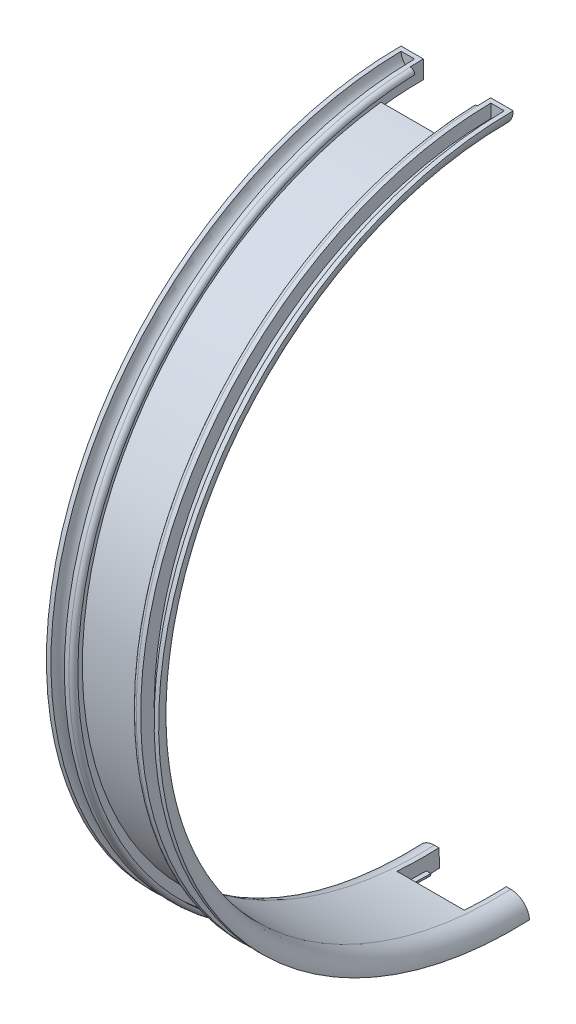
ISO-10303-21;
HEADER;
FILE_DESCRIPTION(('STEP AP214'),'2;1');
FILE_NAME('part.step','',(''),(''),'','','');
FILE_SCHEMA(('AUTOMOTIVE_DESIGN { 1 0 10303 214 1 1 1 1 }'));
ENDSEC;
DATA;
#1=APPLICATION_CONTEXT('core data for automotive mechanical design processes');
#2=APPLICATION_PROTOCOL_DEFINITION('international standard','automotive_design',2000,#1);
#3=PRODUCT_CONTEXT('',#1,'mechanical');
#4=PRODUCT('Part','Part','',(#3));
#5=PRODUCT_RELATED_PRODUCT_CATEGORY('part','',(#4));
#6=PRODUCT_DEFINITION_FORMATION('','',#4);
#7=PRODUCT_DEFINITION_CONTEXT('part definition',#1,'design');
#8=PRODUCT_DEFINITION('design','',#6,#7);
#9=PRODUCT_DEFINITION_SHAPE('','',#8);
#10=(LENGTH_UNIT() NAMED_UNIT(*) SI_UNIT(.MILLI.,.METRE.));
#11=(NAMED_UNIT(*) PLANE_ANGLE_UNIT() SI_UNIT($,.RADIAN.));
#12=(NAMED_UNIT(*) SI_UNIT($,.STERADIAN.) SOLID_ANGLE_UNIT());
#13=UNCERTAINTY_MEASURE_WITH_UNIT(LENGTH_MEASURE(1.E-05),#10,'distance_accuracy_value','');
#14=(GEOMETRIC_REPRESENTATION_CONTEXT(3) GLOBAL_UNCERTAINTY_ASSIGNED_CONTEXT((#13)) GLOBAL_UNIT_ASSIGNED_CONTEXT((#10,
#11,#12)) REPRESENTATION_CONTEXT('',''));
#15=CARTESIAN_POINT('',(0.,0.,0.));
#16=DIRECTION('',(0.,0.,1.));
#17=DIRECTION('',(1.,0.,0.));
#18=AXIS2_PLACEMENT_3D('',#15,#16,#17);
#19=CARTESIAN_POINT('',(-12.427210773158,-68.4885649281417,0.));
#20=DIRECTION('',(-1.,0.,0.));
#21=DIRECTION('',(0.,0.,1.));
#22=AXIS2_PLACEMENT_3D('',#19,#20,#21);
#23=CYLINDRICAL_SURFACE('',#22,78.);
#24=CARTESIAN_POINT('',(2.57278922684203,-68.4885649281417,0.));
#25=DIRECTION('',(-1.,0.,0.));
#26=DIRECTION('',(0.,0.,1.));
#27=AXIS2_PLACEMENT_3D('',#24,#25,#26);
#28=CIRCLE('',#27,78.);
#29=CARTESIAN_POINT('',(2.57278922684203,-146.485824953885,-0.653780143942316));
#30=VERTEX_POINT('',#29);
#31=CARTESIAN_POINT('',(2.57278922684203,9.45652584852879,2.92623030819482));
#32=VERTEX_POINT('',#31);
#33=EDGE_CURVE('E210',#30,#32,#28,.T.);
#34=ORIENTED_EDGE('',*,*,#33,.T.);
#35=DIRECTION('',(-1.,0.,0.));
#36=VECTOR('',#35,1.);
#37=CARTESIAN_POINT('',(0.,9.45652584852879,2.92623030819482));
#38=LINE('',#37,#36);
#39=CARTESIAN_POINT('',(3.57278922684203,9.45652584852879,2.92623030819482));
#40=VERTEX_POINT('',#39);
#41=EDGE_CURVE('E200',#40,#32,#38,.T.);
#42=ORIENTED_EDGE('',*,*,#41,.F.);
#43=CARTESIAN_POINT('',(3.57278922684203,-68.4885649281417,0.));
#44=DIRECTION('',(-1.,0.,0.));
#45=DIRECTION('',(0.,0.,1.));
#46=AXIS2_PLACEMENT_3D('',#43,#44,#45);
#47=CIRCLE('',#46,78.);
#48=CARTESIAN_POINT('',(3.57278922684203,-146.485824953885,-0.653780143942316));
#49=VERTEX_POINT('',#48);
#50=EDGE_CURVE('E47',#49,#40,#47,.T.);
#51=ORIENTED_EDGE('',*,*,#50,.F.);
#52=DIRECTION('',(1.,0.,0.));
#53=VECTOR('',#52,1.);
#54=CARTESIAN_POINT('',(0.,-146.485824953885,-0.653780143942316));
#55=LINE('',#54,#53);
#56=EDGE_CURVE('E364',#30,#49,#55,.T.);
#57=ORIENTED_EDGE('',*,*,#56,.F.);
#58=EDGE_LOOP('',(#34,#42,#51,#57));
#59=FACE_BOUND('',#58,.T.);
#60=ADVANCED_FACE('F39',(#59),#23,.F.);
#61=CARTESIAN_POINT('',(3.57278922684203,-68.4885649281417,0.));
#62=DIRECTION('',(-1.,0.,0.));
#63=DIRECTION('',(0.,0.,1.));
#64=AXIS2_PLACEMENT_3D('',#61,#62,#63);
#65=TOROIDAL_SURFACE('',#64,78.,0.999999999999999);
#66=CARTESIAN_POINT('',(3.57278922684203,9.45652584852878,2.92623030819482));
#67=DIRECTION('',(0.,0.0375157731819848,-0.99929603559834));
#68=DIRECTION('',(0.,0.99929603559834,0.0375157731819848));
#69=AXIS2_PLACEMENT_3D('',#66,#67,#68);
#70=CIRCLE('',#69,0.999999999999999);
#71=CARTESIAN_POINT('',(3.57278922684203,10.4558218841271,2.9637460813768));
#72=VERTEX_POINT('',#71);
#73=EDGE_CURVE('E202',#32,#72,#70,.T.);
#74=ORIENTED_EDGE('',*,*,#73,.F.);
#75=ORIENTED_EDGE('',*,*,#33,.F.);
#76=CARTESIAN_POINT('',(3.57278922684203,-146.485824953885,-0.653780143942316));
#77=DIRECTION('',(0.,0.00838179671720921,-0.999964872124912));
#78=DIRECTION('',(0.,0.999964872124912,0.00838179671720921));
#79=AXIS2_PLACEMENT_3D('',#76,#77,#78);
#80=CIRCLE('',#79,0.999999999999999);
#81=CARTESIAN_POINT('',(3.57278922684203,-147.48578982601,-0.662161940659527));
#82=VERTEX_POINT('',#81);
#83=EDGE_CURVE('E366',#82,#30,#80,.T.);
#84=ORIENTED_EDGE('',*,*,#83,.F.);
#85=CARTESIAN_POINT('',(3.57278922684203,-68.4885649281417,0.));
#86=DIRECTION('',(-1.,0.,0.));
#87=DIRECTION('',(0.,0.,1.));
#88=AXIS2_PLACEMENT_3D('',#85,#86,#87);
#89=CIRCLE('',#88,79.);
#90=EDGE_CURVE('E251',#82,#72,#89,.T.);
#91=ORIENTED_EDGE('',*,*,#90,.T.);
#92=EDGE_LOOP('',(#74,#75,#84,#91));
#93=FACE_BOUND('',#92,.T.);
#94=ADVANCED_FACE('F414',(#93),#65,.T.);
#95=CARTESIAN_POINT('',(-12.427210773158,-68.4885649281417,0.));
#96=DIRECTION('',(-1.,0.,0.));
#97=DIRECTION('',(0.,0.,1.));
#98=AXIS2_PLACEMENT_3D('',#95,#96,#97);
#99=CYLINDRICAL_SURFACE('',#98,78.);
#100=DIRECTION('',(1.,0.,0.));
#101=VECTOR('',#100,1.);
#102=CARTESIAN_POINT('',(0.,9.45652584852879,2.92623030819482));
#103=LINE('',#102,#101);
#104=CARTESIAN_POINT('',(-11.427210773158,9.45652584852879,2.92623030819482));
#105=VERTEX_POINT('',#104);
#106=CARTESIAN_POINT('',(-10.427210773158,9.45652584852879,2.92623030819482));
#107=VERTEX_POINT('',#106);
#108=EDGE_CURVE('E381',#105,#107,#103,.T.);
#109=ORIENTED_EDGE('',*,*,#108,.T.);
#110=CARTESIAN_POINT('',(-10.427210773158,-68.4885649281417,0.));
#111=DIRECTION('',(-1.,0.,0.));
#112=DIRECTION('',(0.,0.,1.));
#113=AXIS2_PLACEMENT_3D('',#110,#111,#112);
#114=CIRCLE('',#113,78.);
#115=CARTESIAN_POINT('',(-10.427210773158,-146.485824953885,-0.653780143942318));
#116=VERTEX_POINT('',#115);
#117=EDGE_CURVE('E221',#116,#107,#114,.T.);
#118=ORIENTED_EDGE('',*,*,#117,.F.);
#119=DIRECTION('',(1.,0.,0.));
#120=VECTOR('',#119,1.);
#121=CARTESIAN_POINT('',(0.,-146.485824953885,-0.653780143942316));
#122=LINE('',#121,#120);
#123=CARTESIAN_POINT('',(-11.427210773158,-146.485824953885,-0.653780143942316));
#124=VERTEX_POINT('',#123);
#125=EDGE_CURVE('E372',#124,#116,#122,.T.);
#126=ORIENTED_EDGE('',*,*,#125,.F.);
#127=CARTESIAN_POINT('',(-11.427210773158,-68.4885649281417,0.));
#128=DIRECTION('',(-1.,0.,0.));
#129=DIRECTION('',(0.,0.,1.));
#130=AXIS2_PLACEMENT_3D('',#127,#128,#129);
#131=CIRCLE('',#130,78.);
#132=EDGE_CURVE('E218',#124,#105,#131,.T.);
#133=ORIENTED_EDGE('',*,*,#132,.T.);
#134=EDGE_LOOP('',(#109,#118,#126,#133));
#135=FACE_BOUND('',#134,.T.);
#136=ADVANCED_FACE('F386',(#135),#99,.F.);
#137=CARTESIAN_POINT('',(-11.427210773158,-68.4885649281417,0.));
#138=DIRECTION('',(-1.,0.,0.));
#139=DIRECTION('',(0.,0.,1.));
#140=AXIS2_PLACEMENT_3D('',#137,#138,#139);
#141=TOROIDAL_SURFACE('',#140,78.,1.);
#142=CARTESIAN_POINT('',(-11.427210773158,9.45652584852878,2.92623030819482));
#143=DIRECTION('',(0.,0.0375157731819848,-0.99929603559834));
#144=DIRECTION('',(0.,0.99929603559834,0.0375157731819848));
#145=AXIS2_PLACEMENT_3D('',#142,#143,#144);
#146=CIRCLE('',#145,1.);
#147=CARTESIAN_POINT('',(-11.427210773158,10.4558218841271,2.9637460813768));
#148=VERTEX_POINT('',#147);
#149=EDGE_CURVE('E374',#148,#107,#146,.T.);
#150=ORIENTED_EDGE('',*,*,#149,.F.);
#151=CARTESIAN_POINT('',(-11.427210773158,-68.4885649281417,0.));
#152=DIRECTION('',(-1.,0.,0.));
#153=DIRECTION('',(0.,0.,1.));
#154=AXIS2_PLACEMENT_3D('',#151,#152,#153);
#155=CIRCLE('',#154,79.);
#156=CARTESIAN_POINT('',(-11.427210773158,-147.48578982601,-0.662161940659525));
#157=VERTEX_POINT('',#156);
#158=EDGE_CURVE('E227',#157,#148,#155,.T.);
#159=ORIENTED_EDGE('',*,*,#158,.F.);
#160=CARTESIAN_POINT('',(-11.427210773158,-146.485824953885,-0.653780143942318));
#161=DIRECTION('',(0.,0.00838179671720921,-0.999964872124912));
#162=DIRECTION('',(0.,0.999964872124912,0.00838179671720921));
#163=AXIS2_PLACEMENT_3D('',#160,#161,#162);
#164=CIRCLE('',#163,1.);
#165=EDGE_CURVE('E11',#116,#157,#164,.T.);
#166=ORIENTED_EDGE('',*,*,#165,.F.);
#167=ORIENTED_EDGE('',*,*,#117,.T.);
#168=EDGE_LOOP('',(#150,#159,#166,#167));
#169=FACE_BOUND('',#168,.T.);
#170=ADVANCED_FACE('F394',(#169),#141,.T.);
#171=CARTESIAN_POINT('',(0.,-136.904975979753,-3.14296432261756));
#172=DIRECTION('',(0.,0.045890351563289,-0.998946482867525));
#173=DIRECTION('',(1.,0.,0.));
#174=AXIS2_PLACEMENT_3D('',#171,#172,#173);
#175=PLANE('',#174);
#176=DIRECTION('',(0.,0.998946482867525,0.045890351563289));
#177=VECTOR('',#176,1.);
#178=CARTESIAN_POINT('',(-11.427210773158,-136.904975979753,-3.14296432261756));
#179=LINE('',#178,#177);
#180=CARTESIAN_POINT('',(-11.427210773158,-147.405337074676,-3.62533777349983));
#181=VERTEX_POINT('',#180);
#182=CARTESIAN_POINT('',(-11.427210773158,-143.409551143206,-3.44177636724667));
#183=VERTEX_POINT('',#182);
#184=EDGE_CURVE('E270',#181,#183,#179,.T.);
#185=ORIENTED_EDGE('',*,*,#184,.F.);
#186=DIRECTION('',(1.,0.,0.));
#187=VECTOR('',#186,1.);
#188=CARTESIAN_POINT('',(0.,-147.405337074676,-3.62533777349983));
#189=LINE('',#188,#187);
#190=CARTESIAN_POINT('',(-16.427210773158,-147.405337074676,-3.62533777349983));
#191=VERTEX_POINT('',#190);
#192=EDGE_CURVE('E267',#191,#181,#189,.T.);
#193=ORIENTED_EDGE('',*,*,#192,.F.);
#194=CARTESIAN_POINT('',(-12.427210773158,-147.405337074676,-3.62533777349983));
#195=DIRECTION('',(0.,0.045890351563289,-0.998946482867525));
#196=DIRECTION('',(1.,0.,0.));
#197=AXIS2_PLACEMENT_3D('',#194,#195,#196);
#198=CIRCLE('',#197,4.);
#199=CARTESIAN_POINT('',(-12.427210773158,-143.409551143206,-3.44177636724667));
#200=VERTEX_POINT('',#199);
#201=EDGE_CURVE('E264',#191,#200,#198,.T.);
#202=ORIENTED_EDGE('',*,*,#201,.T.);
#203=DIRECTION('',(1.,0.,0.));
#204=VECTOR('',#203,1.);
#205=CARTESIAN_POINT('',(0.,-143.409551143206,-3.44177636724667));
#206=LINE('',#205,#204);
#207=EDGE_CURVE('E260',#200,#183,#206,.T.);
#208=ORIENTED_EDGE('',*,*,#207,.T.);
#209=EDGE_LOOP('',(#185,#193,#202,#208));
#210=FACE_BOUND('',#209,.T.);
#211=ADVANCED_FACE('F422',(#210),#175,.T.);
#212=DIRECTION('',(-1.,0.,0.));
#213=VECTOR('',#212,1.);
#214=CARTESIAN_POINT('',(0.,-147.405337074676,-3.62533777349983));
#215=LINE('',#214,#213);
#216=CARTESIAN_POINT('',(8.57278922684203,-147.405337074676,-3.62533777349983));
#217=VERTEX_POINT('',#216);
#218=CARTESIAN_POINT('',(3.57278922684203,-147.405337074676,-3.62533777349983));
#219=VERTEX_POINT('',#218);
#220=EDGE_CURVE('E254',#217,#219,#215,.T.);
#221=ORIENTED_EDGE('',*,*,#220,.T.);
#222=DIRECTION('',(0.,0.998946482867525,0.045890351563289));
#223=VECTOR('',#222,1.);
#224=CARTESIAN_POINT('',(3.57278922684203,-136.904975979753,-3.14296432261756));
#225=LINE('',#224,#223);
#226=CARTESIAN_POINT('',(3.57278922684203,-143.409551143206,-3.44177636724667));
#227=VERTEX_POINT('',#226);
#228=EDGE_CURVE('E272',#219,#227,#225,.T.);
#229=ORIENTED_EDGE('',*,*,#228,.T.);
#230=CARTESIAN_POINT('',(4.57278922684203,-143.409551143206,-3.44177636724667));
#231=VERTEX_POINT('',#230);
#232=EDGE_CURVE('E263',#227,#231,#206,.T.);
#233=ORIENTED_EDGE('',*,*,#232,.T.);
#234=CARTESIAN_POINT('',(4.57278922684203,-147.405337074676,-3.62533777349983));
#235=DIRECTION('',(0.,0.045890351563289,-0.998946482867525));
#236=DIRECTION('',(1.,0.,0.));
#237=AXIS2_PLACEMENT_3D('',#234,#235,#236);
#238=CIRCLE('',#237,4.);
#239=EDGE_CURVE('E257',#231,#217,#238,.T.);
#240=ORIENTED_EDGE('',*,*,#239,.T.);
#241=EDGE_LOOP('',(#221,#229,#233,#240));
#242=FACE_BOUND('',#241,.T.);
#243=ADVANCED_FACE('F448',(#242),#175,.T.);
#244=CARTESIAN_POINT('',(-12.427210773158,-68.4885649281417,0.));
#245=DIRECTION('',(-1.,0.,0.));
#246=DIRECTION('',(0.,0.,1.));
#247=AXIS2_PLACEMENT_3D('',#244,#245,#246);
#248=CYLINDRICAL_SURFACE('',#247,75.);
#249=CARTESIAN_POINT('',(3.57278922684203,-68.4885649281417,0.));
#250=DIRECTION('',(1.,0.,0.));
#251=DIRECTION('',(0.,0.,-1.));
#252=AXIS2_PLACEMENT_3D('',#249,#250,#251);
#253=CIRCLE('',#252,75.);
#254=CARTESIAN_POINT('',(3.57278922684203,-143.254299183955,5.92325765006302));
#255=VERTEX_POINT('',#254);
#256=EDGE_CURVE('E347',#255,#227,#253,.T.);
#257=ORIENTED_EDGE('',*,*,#256,.F.);
#258=DIRECTION('',(-1.,0.,0.));
#259=VECTOR('',#258,1.);
#260=CARTESIAN_POINT('',(3.57278922684203,-143.254299183955,5.92325765006302));
#261=LINE('',#260,#259);
#262=CARTESIAN_POINT('',(-11.427210773158,-143.254299183955,5.92325765006302));
#263=VERTEX_POINT('',#262);
#264=EDGE_CURVE('E359',#255,#263,#261,.T.);
#265=ORIENTED_EDGE('',*,*,#264,.T.);
#266=CARTESIAN_POINT('',(-11.427210773158,-68.4885649281417,0.));
#267=DIRECTION('',(1.,0.,0.));
#268=DIRECTION('',(0.,0.,-1.));
#269=AXIS2_PLACEMENT_3D('',#266,#267,#268);
#270=CIRCLE('',#269,75.);
#271=EDGE_CURVE('E350',#263,#183,#270,.T.);
#272=ORIENTED_EDGE('',*,*,#271,.T.);
#273=ORIENTED_EDGE('',*,*,#207,.F.);
#274=CARTESIAN_POINT('',(-12.427210773158,-68.4885649281417,0.));
#275=DIRECTION('',(-1.,0.,0.));
#276=DIRECTION('',(0.,0.,1.));
#277=AXIS2_PLACEMENT_3D('',#274,#275,#276);
#278=CIRCLE('',#277,75.);
#279=CARTESIAN_POINT('',(-12.427210773158,6.51143507185831,0.));
#280=VERTEX_POINT('',#279);
#281=EDGE_CURVE('E236',#200,#280,#278,.T.);
#282=ORIENTED_EDGE('',*,*,#281,.T.);
#283=DIRECTION('',(1.,0.,0.));
#284=VECTOR('',#283,1.);
#285=CARTESIAN_POINT('',(0.,6.51143507185831,0.));
#286=LINE('',#285,#284);
#287=CARTESIAN_POINT('',(-11.427210773158,6.51143507185831,0.));
#288=VERTEX_POINT('',#287);
#289=EDGE_CURVE('E280',#280,#288,#286,.T.);
#290=ORIENTED_EDGE('',*,*,#289,.T.);
#291=CARTESIAN_POINT('',(-11.427210773158,-68.4885649281417,0.));
#292=DIRECTION('',(-1.,0.,0.));
#293=DIRECTION('',(0.,0.,1.));
#294=AXIS2_PLACEMENT_3D('',#291,#292,#293);
#295=CIRCLE('',#294,75.);
#296=CARTESIAN_POINT('',(-11.427210773158,5.92658196975018,9.34804322653535));
#297=VERTEX_POINT('',#296);
#298=EDGE_CURVE('E330',#297,#288,#295,.T.);
#299=ORIENTED_EDGE('',*,*,#298,.F.);
#300=DIRECTION('',(-1.,0.,0.));
#301=VECTOR('',#300,1.);
#302=CARTESIAN_POINT('',(0.,5.92658196975018,9.34804322653535));
#303=LINE('',#302,#301);
#304=CARTESIAN_POINT('',(3.57278922684203,5.92658196975018,9.34804322653535));
#305=VERTEX_POINT('',#304);
#306=EDGE_CURVE('E345',#305,#297,#303,.T.);
#307=ORIENTED_EDGE('',*,*,#306,.F.);
#308=CARTESIAN_POINT('',(3.57278922684203,-68.4885649281417,0.));
#309=DIRECTION('',(-1.,0.,0.));
#310=DIRECTION('',(0.,0.,1.));
#311=AXIS2_PLACEMENT_3D('',#308,#309,#310);
#312=CIRCLE('',#311,75.);
#313=CARTESIAN_POINT('',(3.57278922684203,6.51143507185831,0.));
#314=VERTEX_POINT('',#313);
#315=EDGE_CURVE('E333',#305,#314,#312,.T.);
#316=ORIENTED_EDGE('',*,*,#315,.T.);
#317=CARTESIAN_POINT('',(4.57278922684203,6.51143507185831,0.));
#318=VERTEX_POINT('',#317);
#319=EDGE_CURVE('E283',#314,#318,#286,.T.);
#320=ORIENTED_EDGE('',*,*,#319,.T.);
#321=CARTESIAN_POINT('',(4.57278922684203,-68.4885649281417,0.));
#322=DIRECTION('',(-1.,0.,0.));
#323=DIRECTION('',(0.,0.,1.));
#324=AXIS2_PLACEMENT_3D('',#321,#322,#323);
#325=CIRCLE('',#324,75.);
#326=EDGE_CURVE('E238',#231,#318,#325,.T.);
#327=ORIENTED_EDGE('',*,*,#326,.F.);
#328=ORIENTED_EDGE('',*,*,#232,.F.);
#329=EDGE_LOOP('',(#257,#265,#272,#273,#282,#290,#299,#307,#316,#320,#327,#328));
#330=FACE_BOUND('',#329,.T.);
#331=ADVANCED_FACE('F444',(#330),#248,.F.);
#332=CARTESIAN_POINT('',(-12.427210773158,-68.4885649281417,0.));
#333=DIRECTION('',(-1.,0.,0.));
#334=DIRECTION('',(0.,0.,1.));
#335=AXIS2_PLACEMENT_3D('',#332,#333,#334);
#336=CYLINDRICAL_SURFACE('',#335,76.);
#337=DIRECTION('',(-1.,0.,0.));
#338=VECTOR('',#337,1.);
#339=CARTESIAN_POINT('',(3.57278922684203,-144.2511756407,6.00223441873053));
#340=LINE('',#339,#338);
#341=CARTESIAN_POINT('',(3.57278922684203,-144.2511756407,6.00223441873053));
#342=VERTEX_POINT('',#341);
#343=CARTESIAN_POINT('',(-11.427210773158,-144.2511756407,6.00223441873053));
#344=VERTEX_POINT('',#343);
#345=EDGE_CURVE('E353',#342,#344,#340,.T.);
#346=ORIENTED_EDGE('',*,*,#345,.F.);
#347=CARTESIAN_POINT('',(3.57278922684203,-68.4885649281417,0.));
#348=DIRECTION('',(-1.,0.,0.));
#349=DIRECTION('',(0.,0.,1.));
#350=AXIS2_PLACEMENT_3D('',#347,#348,#349);
#351=CIRCLE('',#350,76.);
#352=CARTESIAN_POINT('',(3.57278922684203,6.91878392838874,9.47268380288915));
#353=VERTEX_POINT('',#352);
#354=EDGE_CURVE('E213',#342,#353,#351,.T.);
#355=ORIENTED_EDGE('',*,*,#354,.T.);
#356=DIRECTION('',(1.,0.,0.));
#357=VECTOR('',#356,1.);
#358=CARTESIAN_POINT('',(0.,6.91878392838874,9.47268380288915));
#359=LINE('',#358,#357);
#360=CARTESIAN_POINT('',(-11.427210773158,6.91878392838874,9.47268380288915));
#361=VERTEX_POINT('',#360);
#362=EDGE_CURVE('E339',#361,#353,#359,.T.);
#363=ORIENTED_EDGE('',*,*,#362,.F.);
#364=CARTESIAN_POINT('',(-11.427210773158,-68.4885649281417,0.));
#365=DIRECTION('',(-1.,0.,0.));
#366=DIRECTION('',(0.,0.,1.));
#367=AXIS2_PLACEMENT_3D('',#364,#365,#366);
#368=CIRCLE('',#367,76.);
#369=EDGE_CURVE('E214',#344,#361,#368,.T.);
#370=ORIENTED_EDGE('',*,*,#369,.F.);
#371=EDGE_LOOP('',(#346,#355,#363,#370));
#372=FACE_BOUND('',#371,.T.);
#373=ADVANCED_FACE('F447',(#372),#336,.T.);
#374=CARTESIAN_POINT('',(0.,0.,0.));
#375=DIRECTION('',(0.,0.,1.));
#376=DIRECTION('',(1.,0.,0.));
#377=AXIS2_PLACEMENT_3D('',#374,#375,#376);
#378=PLANE('',#377);
#379=DIRECTION('',(0.,-1.,0.));
#380=VECTOR('',#379,1.);
#381=CARTESIAN_POINT('',(3.57278922684203,0.,0.));
#382=LINE('',#381,#380);
#383=CARTESIAN_POINT('',(3.57278922684204,10.5114350718583,0.));
#384=VERTEX_POINT('',#383);
#385=EDGE_CURVE('E292',#384,#314,#382,.T.);
#386=ORIENTED_EDGE('',*,*,#385,.F.);
#387=DIRECTION('',(-1.,0.,0.));
#388=VECTOR('',#387,1.);
#389=CARTESIAN_POINT('',(0.,10.5114350718583,0.));
#390=LINE('',#389,#388);
#391=CARTESIAN_POINT('',(8.57278922684203,10.5114350718583,0.));
#392=VERTEX_POINT('',#391);
#393=EDGE_CURVE('E274',#392,#384,#390,.T.);
#394=ORIENTED_EDGE('',*,*,#393,.F.);
#395=CARTESIAN_POINT('',(4.57278922684203,10.5114350718583,0.));
#396=DIRECTION('',(0.,0.,1.));
#397=DIRECTION('',(1.,0.,0.));
#398=AXIS2_PLACEMENT_3D('',#395,#396,#397);
#399=CIRCLE('',#398,4.);
#400=EDGE_CURVE('E277',#318,#392,#399,.T.);
#401=ORIENTED_EDGE('',*,*,#400,.F.);
#402=ORIENTED_EDGE('',*,*,#319,.F.);
#403=EDGE_LOOP('',(#386,#394,#401,#402));
#404=FACE_BOUND('',#403,.T.);
#405=ADVANCED_FACE('F463',(#404),#378,.F.);
#406=CARTESIAN_POINT('',(-12.427210773158,-136.904975979753,-3.14296432261756));
#407=DIRECTION('',(1.,0.,0.));
#408=DIRECTION('',(0.,0.,-1.));
#409=AXIS2_PLACEMENT_3D('',#406,#407,#408);
#410=PLANE('',#409);
#411=DIRECTION('',(0.,0.99944427024063,0.033333926908996));
#412=VECTOR('',#411,1.);
#413=CARTESIAN_POINT('',(-12.427210773158,-0.110174912181108,2.28058764537024));
#414=LINE('',#413,#412);
#415=CARTESIAN_POINT('',(-12.427210773158,-147.444662277151,-2.63338022581068));
#416=VERTEX_POINT('',#415);
#417=CARTESIAN_POINT('',(-12.427210773158,-144.44632946643,-2.53337844508369));
#418=VERTEX_POINT('',#417);
#419=EDGE_CURVE('E321',#416,#418,#414,.T.);
#420=ORIENTED_EDGE('',*,*,#419,.F.);
#421=CARTESIAN_POINT('',(-12.427210773158,-68.4885649281417,0.));
#422=DIRECTION('',(-1.,0.,0.));
#423=DIRECTION('',(0.,0.,1.));
#424=AXIS2_PLACEMENT_3D('',#421,#422,#423);
#425=CIRCLE('',#424,79.);
#426=CARTESIAN_POINT('',(-12.427210773158,10.5051975639598,0.992717150784858));
#427=VERTEX_POINT('',#426);
#428=EDGE_CURVE('E228',#416,#427,#425,.T.);
#429=ORIENTED_EDGE('',*,*,#428,.T.);
#430=DIRECTION('',(0.,0.999921044203816,0.0125660398833526));
#431=VECTOR('',#430,1.);
#432=CARTESIAN_POINT('',(-12.427210773158,-0.00540756917339499,0.860630038440615));
#433=LINE('',#432,#431);
#434=CARTESIAN_POINT('',(-12.427210773158,7.50543443134833,0.9550190311348));
#435=VERTEX_POINT('',#434);
#436=EDGE_CURVE('E306',#435,#427,#433,.T.);
#437=ORIENTED_EDGE('',*,*,#436,.F.);
#438=CARTESIAN_POINT('',(-12.427210773158,-68.4885649281417,0.));
#439=DIRECTION('',(-1.,0.,0.));
#440=DIRECTION('',(0.,0.,1.));
#441=AXIS2_PLACEMENT_3D('',#438,#439,#440);
#442=CIRCLE('',#441,76.);
#443=EDGE_CURVE('E230',#418,#435,#442,.T.);
#444=ORIENTED_EDGE('',*,*,#443,.F.);
#445=EDGE_LOOP('',(#420,#429,#437,#444));
#446=FACE_BOUND('',#445,.T.);
#447=ADVANCED_FACE('F459',(#446),#410,.F.);
#448=CARTESIAN_POINT('',(-12.427210773158,-68.4885649281417,0.));
#449=DIRECTION('',(-1.,0.,0.));
#450=DIRECTION('',(0.,0.,1.));
#451=AXIS2_PLACEMENT_3D('',#448,#449,#450);
#452=TOROIDAL_SURFACE('',#451,79.,3.);
#453=CARTESIAN_POINT('',(-15.427210773158,-68.4885649281417,0.));
#454=DIRECTION('',(-1.,0.,0.));
#455=DIRECTION('',(0.,0.,1.));
#456=AXIS2_PLACEMENT_3D('',#453,#454,#455);
#457=CIRCLE('',#456,79.);
#458=CARTESIAN_POINT('',(-15.427210773158,-147.444662277151,-2.63338022581068));
#459=VERTEX_POINT('',#458);
#460=CARTESIAN_POINT('',(-15.427210773158,10.5051975639598,0.992717150784858));
#461=VERTEX_POINT('',#460);
#462=EDGE_CURVE('E232',#459,#461,#457,.T.);
#463=ORIENTED_EDGE('',*,*,#462,.F.);
#464=CARTESIAN_POINT('',(-12.427210773158,-147.444662277151,-2.63338022581068));
#465=DIRECTION('',(0.,0.033333926908996,-0.99944427024063));
#466=DIRECTION('',(0.,0.99944427024063,0.033333926908996));
#467=AXIS2_PLACEMENT_3D('',#464,#465,#466);
#468=CIRCLE('',#467,3.);
#469=EDGE_CURVE('E324',#418,#459,#468,.F.);
#470=ORIENTED_EDGE('',*,*,#469,.F.);
#471=ORIENTED_EDGE('',*,*,#443,.T.);
#472=CARTESIAN_POINT('',(-12.427210773158,10.5051975639598,0.992717150784858));
#473=DIRECTION('',(0.,0.0125660398833526,-0.999921044203816));
#474=DIRECTION('',(-1.,0.,0.));
#475=AXIS2_PLACEMENT_3D('',#472,#473,#474);
#476=CIRCLE('',#475,3.);
#477=EDGE_CURVE('E303',#461,#435,#476,.F.);
#478=ORIENTED_EDGE('',*,*,#477,.F.);
#479=EDGE_LOOP('',(#463,#470,#471,#478));
#480=FACE_BOUND('',#479,.T.);
#481=ADVANCED_FACE('F438',(#480),#452,.F.);
#482=CARTESIAN_POINT('',(4.57278922684203,-68.4885649281417,0.));
#483=DIRECTION('',(-1.,0.,0.));
#484=DIRECTION('',(0.,0.,1.));
#485=AXIS2_PLACEMENT_3D('',#482,#483,#484);
#486=TOROIDAL_SURFACE('',#485,79.,3.);
#487=CARTESIAN_POINT('',(4.57278922684203,-68.4885649281417,0.));
#488=DIRECTION('',(-1.,0.,0.));
#489=DIRECTION('',(0.,0.,1.));
#490=AXIS2_PLACEMENT_3D('',#487,#488,#489);
#491=CIRCLE('',#490,76.);
#492=CARTESIAN_POINT('',(4.57278922684203,-144.44632946643,-2.53337844508369));
#493=VERTEX_POINT('',#492);
#494=CARTESIAN_POINT('',(4.57278922684203,7.50543443134833,0.9550190311348));
#495=VERTEX_POINT('',#494);
#496=EDGE_CURVE('E245',#493,#495,#491,.T.);
#497=ORIENTED_EDGE('',*,*,#496,.F.);
#498=CARTESIAN_POINT('',(4.57278922684203,-147.444662277151,-2.63338022581068));
#499=DIRECTION('',(0.,0.033333926908996,-0.99944427024063));
#500=DIRECTION('',(0.,0.99944427024063,0.033333926908996));
#501=AXIS2_PLACEMENT_3D('',#498,#499,#500);
#502=CIRCLE('',#501,3.);
#503=CARTESIAN_POINT('',(7.57278922684203,-147.444662277151,-2.63338022581068));
#504=VERTEX_POINT('',#503);
#505=EDGE_CURVE('E312',#504,#493,#502,.F.);
#506=ORIENTED_EDGE('',*,*,#505,.F.);
#507=CARTESIAN_POINT('',(7.57278922684203,-68.4885649281417,0.));
#508=DIRECTION('',(-1.,0.,0.));
#509=DIRECTION('',(0.,0.,1.));
#510=AXIS2_PLACEMENT_3D('',#507,#508,#509);
#511=CIRCLE('',#510,79.);
#512=CARTESIAN_POINT('',(7.57278922684203,10.5051975639598,0.992717150784858));
#513=VERTEX_POINT('',#512);
#514=EDGE_CURVE('E243',#504,#513,#511,.T.);
#515=ORIENTED_EDGE('',*,*,#514,.T.);
#516=CARTESIAN_POINT('',(4.57278922684203,10.5051975639598,0.992717150784858));
#517=DIRECTION('',(0.,0.0125660398833526,-0.999921044203816));
#518=DIRECTION('',(-1.,0.,0.));
#519=AXIS2_PLACEMENT_3D('',#516,#517,#518);
#520=CIRCLE('',#519,3.);
#521=EDGE_CURVE('E294',#495,#513,#520,.F.);
#522=ORIENTED_EDGE('',*,*,#521,.F.);
#523=EDGE_LOOP('',(#497,#506,#515,#522));
#524=FACE_BOUND('',#523,.T.);
#525=ADVANCED_FACE('F434',(#524),#486,.F.);
#526=CARTESIAN_POINT('',(4.57278922684203,-136.904975979753,-3.14296432261756));
#527=DIRECTION('',(1.,0.,0.));
#528=DIRECTION('',(0.,0.,-1.));
#529=AXIS2_PLACEMENT_3D('',#526,#527,#528);
#530=PLANE('',#529);
#531=CARTESIAN_POINT('',(4.57278922684203,-68.4885649281417,0.));
#532=DIRECTION('',(-1.,0.,0.));
#533=DIRECTION('',(0.,0.,1.));
#534=AXIS2_PLACEMENT_3D('',#531,#532,#533);
#535=CIRCLE('',#534,79.);
#536=CARTESIAN_POINT('',(4.57278922684203,-147.444662277151,-2.63338022581068));
#537=VERTEX_POINT('',#536);
#538=CARTESIAN_POINT('',(4.57278922684203,10.5051975639598,0.992717150784858));
#539=VERTEX_POINT('',#538);
#540=EDGE_CURVE('E247',#537,#539,#535,.T.);
#541=ORIENTED_EDGE('',*,*,#540,.F.);
#542=DIRECTION('',(0.,-0.99944427024063,-0.033333926908996));
#543=VECTOR('',#542,1.);
#544=CARTESIAN_POINT('',(4.57278922684203,-0.110174912181109,2.28058764537024));
#545=LINE('',#544,#543);
#546=EDGE_CURVE('E315',#493,#537,#545,.T.);
#547=ORIENTED_EDGE('',*,*,#546,.F.);
#548=ORIENTED_EDGE('',*,*,#496,.T.);
#549=DIRECTION('',(0.,-0.999921044203816,-0.0125660398833526));
#550=VECTOR('',#549,1.);
#551=CARTESIAN_POINT('',(4.57278922684203,-0.00540756917339335,0.860630038440615));
#552=LINE('',#551,#550);
#553=EDGE_CURVE('E300',#539,#495,#552,.T.);
#554=ORIENTED_EDGE('',*,*,#553,.F.);
#555=EDGE_LOOP('',(#541,#547,#548,#554));
#556=FACE_BOUND('',#555,.T.);
#557=ADVANCED_FACE('F431',(#556),#530,.T.);
#558=CARTESIAN_POINT('',(3.57278922684203,-136.904975979753,-3.14296432261756));
#559=DIRECTION('',(1.,0.,0.));
#560=DIRECTION('',(0.,0.,-1.));
#561=AXIS2_PLACEMENT_3D('',#558,#559,#560);
#562=PLANE('',#561);
#563=ORIENTED_EDGE('',*,*,#354,.F.);
#564=DIRECTION('',(0.,0.996876456744184,-0.0789767686675072));
#565=VECTOR('',#564,1.);
#566=CARTESIAN_POINT('',(3.57278922684203,-144.2511756407,6.00223441873053));
#567=LINE('',#566,#565);
#568=EDGE_CURVE('E362',#342,#255,#567,.T.);
#569=ORIENTED_EDGE('',*,*,#568,.T.);
#570=ORIENTED_EDGE('',*,*,#256,.T.);
#571=ORIENTED_EDGE('',*,*,#228,.F.);
#572=EDGE_CURVE('E249',#219,#82,#89,.T.);
#573=ORIENTED_EDGE('',*,*,#572,.T.);
#574=DIRECTION('',(0.,0.999964872124912,0.00838179671720921));
#575=VECTOR('',#574,1.);
#576=CARTESIAN_POINT('',(3.57278922684203,-0.0745571996718424,0.573452449555633));
#577=LINE('',#576,#575);
#578=EDGE_CURVE('E62',#82,#49,#577,.T.);
#579=ORIENTED_EDGE('',*,*,#578,.T.);
#580=ORIENTED_EDGE('',*,*,#50,.T.);
#581=DIRECTION('',(0.,-0.99929603559834,-0.0375157731819848));
#582=VECTOR('',#581,1.);
#583=CARTESIAN_POINT('',(3.57278922684203,-0.048213511630221,2.5694014674038));
#584=LINE('',#583,#582);
#585=EDGE_CURVE('E54',#72,#40,#584,.T.);
#586=ORIENTED_EDGE('',*,*,#585,.F.);
#587=EDGE_CURVE('E252',#72,#384,#89,.T.);
#588=ORIENTED_EDGE('',*,*,#587,.T.);
#589=ORIENTED_EDGE('',*,*,#385,.T.);
#590=ORIENTED_EDGE('',*,*,#315,.F.);
#591=DIRECTION('',(0.,0.992201958638558,0.124640576353805));
#592=VECTOR('',#591,1.);
#593=CARTESIAN_POINT('',(3.57278922684203,-0.534076662095433,8.53645420628855));
#594=LINE('',#593,#592);
#595=EDGE_CURVE('E336',#305,#353,#594,.T.);
#596=ORIENTED_EDGE('',*,*,#595,.T.);
#597=EDGE_LOOP('',(#563,#569,#570,#571,#573,#579,#580,#586,#588,#589,#590,#596));
#598=FACE_BOUND('',#597,.T.);
#599=ADVANCED_FACE('F41',(#598),#562,.F.);
#600=CARTESIAN_POINT('',(-11.427210773158,-136.904975979753,-3.14296432261756));
#601=DIRECTION('',(1.,0.,0.));
#602=DIRECTION('',(0.,0.,-1.));
#603=AXIS2_PLACEMENT_3D('',#600,#601,#602);
#604=PLANE('',#603);
#605=ORIENTED_EDGE('',*,*,#132,.F.);
#606=DIRECTION('',(0.,-0.999964872124912,-0.00838179671720921));
#607=VECTOR('',#606,1.);
#608=CARTESIAN_POINT('',(-11.427210773158,-0.0745571996718423,0.573452449555633));
#609=LINE('',#608,#607);
#610=EDGE_CURVE('E369',#124,#157,#609,.T.);
#611=ORIENTED_EDGE('',*,*,#610,.T.);
#612=EDGE_CURVE('E224',#181,#157,#155,.T.);
#613=ORIENTED_EDGE('',*,*,#612,.F.);
#614=ORIENTED_EDGE('',*,*,#184,.T.);
#615=ORIENTED_EDGE('',*,*,#271,.F.);
#616=DIRECTION('',(0.,0.996876456744184,-0.0789767686675072));
#617=VECTOR('',#616,1.);
#618=CARTESIAN_POINT('',(-11.427210773158,-144.2511756407,6.00223441873053));
#619=LINE('',#618,#617);
#620=EDGE_CURVE('E356',#344,#263,#619,.T.);
#621=ORIENTED_EDGE('',*,*,#620,.F.);
#622=ORIENTED_EDGE('',*,*,#369,.T.);
#623=DIRECTION('',(0.,0.992201958638558,0.124640576353805));
#624=VECTOR('',#623,1.);
#625=CARTESIAN_POINT('',(-11.427210773158,-0.534076662095433,8.53645420628855));
#626=LINE('',#625,#624);
#627=EDGE_CURVE('E342',#297,#361,#626,.T.);
#628=ORIENTED_EDGE('',*,*,#627,.F.);
#629=ORIENTED_EDGE('',*,*,#298,.T.);
#630=DIRECTION('',(0.,-1.,0.));
#631=VECTOR('',#630,1.);
#632=CARTESIAN_POINT('',(-11.427210773158,0.,0.));
#633=LINE('',#632,#631);
#634=CARTESIAN_POINT('',(-11.427210773158,10.5114350718583,0.));
#635=VERTEX_POINT('',#634);
#636=EDGE_CURVE('E290',#635,#288,#633,.T.);
#637=ORIENTED_EDGE('',*,*,#636,.F.);
#638=CARTESIAN_POINT('',(-11.427210773158,-68.4885649281417,0.));
#639=DIRECTION('',(-1.,0.,0.));
#640=DIRECTION('',(0.,0.,1.));
#641=AXIS2_PLACEMENT_3D('',#638,#639,#640);
#642=CIRCLE('',#641,79.);
#643=EDGE_CURVE('E376',#635,#148,#642,.F.);
#644=ORIENTED_EDGE('',*,*,#643,.T.);
#645=DIRECTION('',(0.,0.99929603559834,0.0375157731819848));
#646=VECTOR('',#645,1.);
#647=CARTESIAN_POINT('',(-11.427210773158,-0.0482135116302207,2.5694014674038));
#648=LINE('',#647,#646);
#649=EDGE_CURVE('E378',#105,#148,#648,.T.);
#650=ORIENTED_EDGE('',*,*,#649,.F.);
#651=EDGE_LOOP('',(#605,#611,#613,#614,#615,#621,#622,#628,#629,#637,#644,#650));
#652=FACE_BOUND('',#651,.T.);
#653=ADVANCED_FACE('F401',(#652),#604,.T.);
#654=CARTESIAN_POINT('',(-12.427210773158,-68.4885649281417,0.));
#655=DIRECTION('',(-1.,0.,0.));
#656=DIRECTION('',(0.,0.,1.));
#657=AXIS2_PLACEMENT_3D('',#654,#655,#656);
#658=CYLINDRICAL_SURFACE('',#657,79.);
#659=ORIENTED_EDGE('',*,*,#428,.F.);
#660=DIRECTION('',(1.,0.,0.));
#661=VECTOR('',#660,1.);
#662=CARTESIAN_POINT('',(0.,-147.444662277151,-2.63338022581068));
#663=LINE('',#662,#661);
#664=EDGE_CURVE('E327',#459,#416,#663,.T.);
#665=ORIENTED_EDGE('',*,*,#664,.F.);
#666=ORIENTED_EDGE('',*,*,#462,.T.);
#667=DIRECTION('',(-1.,0.,0.));
#668=VECTOR('',#667,1.);
#669=CARTESIAN_POINT('',(0.,10.5051975639598,0.992717150784858));
#670=LINE('',#669,#668);
#671=EDGE_CURVE('E309',#427,#461,#670,.T.);
#672=ORIENTED_EDGE('',*,*,#671,.F.);
#673=EDGE_LOOP('',(#659,#665,#666,#672));
#674=FACE_BOUND('',#673,.T.);
#675=CARTESIAN_POINT('',(-16.427210773158,-68.4885649281417,0.));
#676=DIRECTION('',(-1.,0.,0.));
#677=DIRECTION('',(0.,0.,1.));
#678=AXIS2_PLACEMENT_3D('',#675,#676,#677);
#679=CIRCLE('',#678,79.);
#680=CARTESIAN_POINT('',(-16.427210773158,10.5114350718583,0.));
#681=VERTEX_POINT('',#680);
#682=EDGE_CURVE('E234',#191,#681,#679,.T.);
#683=ORIENTED_EDGE('',*,*,#682,.F.);
#684=ORIENTED_EDGE('',*,*,#192,.T.);
#685=ORIENTED_EDGE('',*,*,#612,.T.);
#686=ORIENTED_EDGE('',*,*,#158,.T.);
#687=ORIENTED_EDGE('',*,*,#643,.F.);
#688=DIRECTION('',(1.,0.,0.));
#689=VECTOR('',#688,1.);
#690=CARTESIAN_POINT('',(0.,10.5114350718583,0.));
#691=LINE('',#690,#689);
#692=EDGE_CURVE('E287',#681,#635,#691,.T.);
#693=ORIENTED_EDGE('',*,*,#692,.F.);
#694=EDGE_LOOP('',(#683,#684,#685,#686,#687,#693));
#695=FACE_BOUND('',#694,.T.);
#696=ADVANCED_FACE('F452',(#674,#695),#658,.T.);
#697=CARTESIAN_POINT('',(-12.427210773158,-68.4885649281417,0.));
#698=DIRECTION('',(-1.,0.,0.));
#699=DIRECTION('',(0.,0.,1.));
#700=AXIS2_PLACEMENT_3D('',#697,#698,#699);
#701=TOROIDAL_SURFACE('',#700,79.,4.);
#702=ORIENTED_EDGE('',*,*,#281,.F.);
#703=ORIENTED_EDGE('',*,*,#201,.F.);
#704=ORIENTED_EDGE('',*,*,#682,.T.);
#705=CARTESIAN_POINT('',(-12.427210773158,10.5114350718583,0.));
#706=DIRECTION('',(0.,0.,1.));
#707=DIRECTION('',(1.,0.,0.));
#708=AXIS2_PLACEMENT_3D('',#705,#706,#707);
#709=CIRCLE('',#708,4.);
#710=EDGE_CURVE('E284',#681,#280,#709,.T.);
#711=ORIENTED_EDGE('',*,*,#710,.T.);
#712=EDGE_LOOP('',(#702,#703,#704,#711));
#713=FACE_BOUND('',#712,.T.);
#714=ADVANCED_FACE('F442',(#713),#701,.T.);
#715=CARTESIAN_POINT('',(4.57278922684203,-68.4885649281417,0.));
#716=DIRECTION('',(-1.,0.,0.));
#717=DIRECTION('',(0.,0.,1.));
#718=AXIS2_PLACEMENT_3D('',#715,#716,#717);
#719=TOROIDAL_SURFACE('',#718,79.,4.);
#720=CARTESIAN_POINT('',(8.57278922684203,-68.4885649281417,0.));
#721=DIRECTION('',(-1.,0.,0.));
#722=DIRECTION('',(0.,0.,1.));
#723=AXIS2_PLACEMENT_3D('',#720,#721,#722);
#724=CIRCLE('',#723,79.);
#725=EDGE_CURVE('E241',#217,#392,#724,.T.);
#726=ORIENTED_EDGE('',*,*,#725,.F.);
#727=ORIENTED_EDGE('',*,*,#239,.F.);
#728=ORIENTED_EDGE('',*,*,#326,.T.);
#729=ORIENTED_EDGE('',*,*,#400,.T.);
#730=EDGE_LOOP('',(#726,#727,#728,#729));
#731=FACE_BOUND('',#730,.T.);
#732=ADVANCED_FACE('F429',(#731),#719,.T.);
#733=CARTESIAN_POINT('',(-12.427210773158,-68.4885649281417,0.));
#734=DIRECTION('',(-1.,0.,0.));
#735=DIRECTION('',(0.,0.,1.));
#736=AXIS2_PLACEMENT_3D('',#733,#734,#735);
#737=CYLINDRICAL_SURFACE('',#736,79.);
#738=ORIENTED_EDGE('',*,*,#514,.F.);
#739=DIRECTION('',(1.,0.,0.));
#740=VECTOR('',#739,1.);
#741=CARTESIAN_POINT('',(0.,-147.444662277151,-2.63338022581068));
#742=LINE('',#741,#740);
#743=EDGE_CURVE('E318',#537,#504,#742,.T.);
#744=ORIENTED_EDGE('',*,*,#743,.F.);
#745=ORIENTED_EDGE('',*,*,#540,.T.);
#746=DIRECTION('',(1.,0.,0.));
#747=VECTOR('',#746,1.);
#748=CARTESIAN_POINT('',(0.,10.5051975639598,0.992717150784858));
#749=LINE('',#748,#747);
#750=EDGE_CURVE('E297',#539,#513,#749,.T.);
#751=ORIENTED_EDGE('',*,*,#750,.T.);
#752=EDGE_LOOP('',(#738,#744,#745,#751));
#753=FACE_BOUND('',#752,.T.);
#754=ORIENTED_EDGE('',*,*,#572,.F.);
#755=ORIENTED_EDGE('',*,*,#220,.F.);
#756=ORIENTED_EDGE('',*,*,#725,.T.);
#757=ORIENTED_EDGE('',*,*,#393,.T.);
#758=ORIENTED_EDGE('',*,*,#587,.F.);
#759=ORIENTED_EDGE('',*,*,#90,.F.);
#760=EDGE_LOOP('',(#754,#755,#756,#757,#758,#759));
#761=FACE_BOUND('',#760,.T.);
#762=ADVANCED_FACE('F425',(#753,#761),#737,.T.);
#763=ORIENTED_EDGE('',*,*,#692,.T.);
#764=ORIENTED_EDGE('',*,*,#636,.T.);
#765=ORIENTED_EDGE('',*,*,#289,.F.);
#766=ORIENTED_EDGE('',*,*,#710,.F.);
#767=EDGE_LOOP('',(#763,#764,#765,#766));
#768=FACE_BOUND('',#767,.T.);
#769=ADVANCED_FACE('F428',(#768),#378,.F.);
#770=CARTESIAN_POINT('',(0.,-0.00540756917339335,0.860630038440615));
#771=DIRECTION('',(0.,0.0125660398833526,-0.999921044203816));
#772=DIRECTION('',(-1.,0.,0.));
#773=AXIS2_PLACEMENT_3D('',#770,#771,#772);
#774=PLANE('',#773);
#775=ORIENTED_EDGE('',*,*,#553,.T.);
#776=ORIENTED_EDGE('',*,*,#521,.T.);
#777=ORIENTED_EDGE('',*,*,#750,.F.);
#778=EDGE_LOOP('',(#775,#776,#777));
#779=FACE_BOUND('',#778,.T.);
#780=ADVANCED_FACE('F524',(#779),#774,.F.);
#781=CARTESIAN_POINT('',(0.,-0.00540756917339335,0.860630038440615));
#782=DIRECTION('',(0.,0.0125660398833526,-0.999921044203816));
#783=DIRECTION('',(-1.,0.,0.));
#784=AXIS2_PLACEMENT_3D('',#781,#782,#783);
#785=PLANE('',#784);
#786=ORIENTED_EDGE('',*,*,#671,.T.);
#787=ORIENTED_EDGE('',*,*,#477,.T.);
#788=ORIENTED_EDGE('',*,*,#436,.T.);
#789=EDGE_LOOP('',(#786,#787,#788));
#790=FACE_BOUND('',#789,.T.);
#791=ADVANCED_FACE('F520',(#790),#785,.F.);
#792=CARTESIAN_POINT('',(0.,-0.110174912181109,2.28058764537024));
#793=DIRECTION('',(0.,0.033333926908996,-0.99944427024063));
#794=DIRECTION('',(0.,0.99944427024063,0.033333926908996));
#795=AXIS2_PLACEMENT_3D('',#792,#793,#794);
#796=PLANE('',#795);
#797=ORIENTED_EDGE('',*,*,#743,.T.);
#798=ORIENTED_EDGE('',*,*,#505,.T.);
#799=ORIENTED_EDGE('',*,*,#546,.T.);
#800=EDGE_LOOP('',(#797,#798,#799));
#801=FACE_BOUND('',#800,.T.);
#802=ADVANCED_FACE('F516',(#801),#796,.F.);
#803=CARTESIAN_POINT('',(0.,-0.110174912181109,2.28058764537024));
#804=DIRECTION('',(0.,0.033333926908996,-0.99944427024063));
#805=DIRECTION('',(0.,0.99944427024063,0.033333926908996));
#806=AXIS2_PLACEMENT_3D('',#803,#804,#805);
#807=PLANE('',#806);
#808=ORIENTED_EDGE('',*,*,#664,.T.);
#809=ORIENTED_EDGE('',*,*,#419,.T.);
#810=ORIENTED_EDGE('',*,*,#469,.T.);
#811=EDGE_LOOP('',(#808,#809,#810));
#812=FACE_BOUND('',#811,.T.);
#813=ADVANCED_FACE('F513',(#812),#807,.F.);
#814=CARTESIAN_POINT('',(0.,-0.534076662095433,8.53645420628855));
#815=DIRECTION('',(0.,0.124640576353805,-0.992201958638558));
#816=DIRECTION('',(-1.,0.,0.));
#817=AXIS2_PLACEMENT_3D('',#814,#815,#816);
#818=PLANE('',#817);
#819=ORIENTED_EDGE('',*,*,#306,.T.);
#820=ORIENTED_EDGE('',*,*,#627,.T.);
#821=ORIENTED_EDGE('',*,*,#362,.T.);
#822=ORIENTED_EDGE('',*,*,#595,.F.);
#823=EDGE_LOOP('',(#819,#820,#821,#822));
#824=FACE_BOUND('',#823,.T.);
#825=ADVANCED_FACE('F484',(#824),#818,.T.);
#826=CARTESIAN_POINT('',(0.,-0.28585549585784,-5.4033070686842));
#827=DIRECTION('',(0.,0.0789767686675072,0.996876456744184));
#828=DIRECTION('',(0.,-0.996876456744184,0.0789767686675072));
#829=AXIS2_PLACEMENT_3D('',#826,#827,#828);
#830=PLANE('',#829);
#831=ORIENTED_EDGE('',*,*,#568,.F.);
#832=ORIENTED_EDGE('',*,*,#345,.T.);
#833=ORIENTED_EDGE('',*,*,#620,.T.);
#834=ORIENTED_EDGE('',*,*,#264,.F.);
#835=EDGE_LOOP('',(#831,#832,#833,#834));
#836=FACE_BOUND('',#835,.T.);
#837=ADVANCED_FACE('F490',(#836),#830,.F.);
#838=CARTESIAN_POINT('',(0.,-0.0745571996718423,0.573452449555633));
#839=DIRECTION('',(0.,0.00838179671720921,-0.999964872124912));
#840=DIRECTION('',(0.,0.999964872124912,0.00838179671720921));
#841=AXIS2_PLACEMENT_3D('',#838,#839,#840);
#842=PLANE('',#841);
#843=ORIENTED_EDGE('',*,*,#578,.F.);
#844=ORIENTED_EDGE('',*,*,#83,.T.);
#845=ORIENTED_EDGE('',*,*,#56,.T.);
#846=EDGE_LOOP('',(#843,#844,#845));
#847=FACE_BOUND('',#846,.T.);
#848=ADVANCED_FACE('F411',(#847),#842,.T.);
#849=CARTESIAN_POINT('',(0.,-0.0745571996718423,0.573452449555633));
#850=DIRECTION('',(0.,0.00838179671720921,-0.999964872124912));
#851=DIRECTION('',(0.,0.999964872124912,0.00838179671720921));
#852=AXIS2_PLACEMENT_3D('',#849,#850,#851);
#853=PLANE('',#852);
#854=ORIENTED_EDGE('',*,*,#165,.T.);
#855=ORIENTED_EDGE('',*,*,#610,.F.);
#856=ORIENTED_EDGE('',*,*,#125,.T.);
#857=EDGE_LOOP('',(#854,#855,#856));
#858=FACE_BOUND('',#857,.T.);
#859=ADVANCED_FACE('F398',(#858),#853,.T.);
#860=CARTESIAN_POINT('',(0.,-0.0482135116302207,2.5694014674038));
#861=DIRECTION('',(0.,0.0375157731819848,-0.99929603559834));
#862=DIRECTION('',(-1.,0.,0.));
#863=AXIS2_PLACEMENT_3D('',#860,#861,#862);
#864=PLANE('',#863);
#865=ORIENTED_EDGE('',*,*,#149,.T.);
#866=ORIENTED_EDGE('',*,*,#108,.F.);
#867=ORIENTED_EDGE('',*,*,#649,.T.);
#868=EDGE_LOOP('',(#865,#866,#867));
#869=FACE_BOUND('',#868,.T.);
#870=ADVANCED_FACE('F403',(#869),#864,.T.);
#871=CARTESIAN_POINT('',(0.,-0.0482135116302207,2.5694014674038));
#872=DIRECTION('',(0.,0.0375157731819848,-0.99929603559834));
#873=DIRECTION('',(-1.,0.,0.));
#874=AXIS2_PLACEMENT_3D('',#871,#872,#873);
#875=PLANE('',#874);
#876=ORIENTED_EDGE('',*,*,#73,.T.);
#877=ORIENTED_EDGE('',*,*,#585,.T.);
#878=ORIENTED_EDGE('',*,*,#41,.T.);
#879=EDGE_LOOP('',(#876,#877,#878));
#880=FACE_BOUND('',#879,.T.);
#881=ADVANCED_FACE('F199',(#880),#875,.T.);
#882=CLOSED_SHELL('',(#60,#94,#136,#170,#211,#243,#331,#373,#405,#447,#481,#525,#557,#599,#653,
#696,#714,#732,#762,#769,#780,#791,#802,#813,#825,#837,#848,#859,#870,#881));
#883=MANIFOLD_SOLID_BREP('B2',#882);
#884=ADVANCED_BREP_SHAPE_REPRESENTATION('',(#18,#883),#14);
#885=SHAPE_DEFINITION_REPRESENTATION(#9,#884);
ENDSEC;
END-ISO-10303-21;
